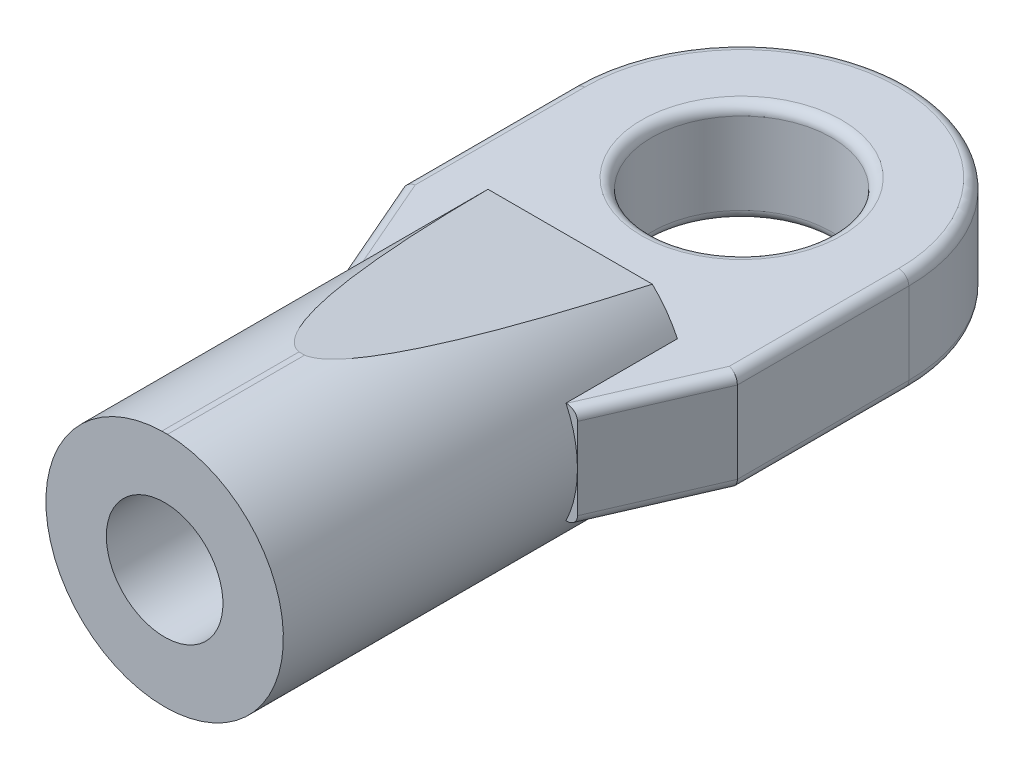
ISO-10303-21;
HEADER;
FILE_DESCRIPTION(('STEP AP214'),'2;1');
FILE_NAME('part.step','',(''),(''),'','','');
FILE_SCHEMA(('AUTOMOTIVE_DESIGN { 1 0 10303 214 1 1 1 1 }'));
ENDSEC;
DATA;
#1=APPLICATION_CONTEXT('core data for automotive mechanical design processes');
#2=APPLICATION_PROTOCOL_DEFINITION('international standard','automotive_design',2000,#1);
#3=PRODUCT_CONTEXT('',#1,'mechanical');
#4=PRODUCT('Part','Part','',(#3));
#5=PRODUCT_RELATED_PRODUCT_CATEGORY('part','',(#4));
#6=PRODUCT_DEFINITION_FORMATION('','',#4);
#7=PRODUCT_DEFINITION_CONTEXT('part definition',#1,'design');
#8=PRODUCT_DEFINITION('design','',#6,#7);
#9=PRODUCT_DEFINITION_SHAPE('','',#8);
#10=(LENGTH_UNIT() NAMED_UNIT(*) SI_UNIT(.MILLI.,.METRE.));
#11=(NAMED_UNIT(*) PLANE_ANGLE_UNIT() SI_UNIT($,.RADIAN.));
#12=(NAMED_UNIT(*) SI_UNIT($,.STERADIAN.) SOLID_ANGLE_UNIT());
#13=UNCERTAINTY_MEASURE_WITH_UNIT(LENGTH_MEASURE(1.E-05),#10,'distance_accuracy_value','');
#14=(GEOMETRIC_REPRESENTATION_CONTEXT(3) GLOBAL_UNCERTAINTY_ASSIGNED_CONTEXT((#13)) GLOBAL_UNIT_ASSIGNED_CONTEXT((#10,
#11,#12)) REPRESENTATION_CONTEXT('',''));
#15=CARTESIAN_POINT('',(0.,0.,0.));
#16=DIRECTION('',(0.,0.,1.));
#17=DIRECTION('',(1.,0.,0.));
#18=AXIS2_PLACEMENT_3D('',#15,#16,#17);
#19=CARTESIAN_POINT('',(0.,-1.21,0.));
#20=DIRECTION('',(0.,1.,0.));
#21=DIRECTION('',(0.,0.,1.));
#22=AXIS2_PLACEMENT_3D('',#19,#20,#21);
#23=TOROIDAL_SURFACE('',#22,2.967,0.3);
#24=CARTESIAN_POINT('',(0.,-1.51,0.));
#25=DIRECTION('',(0.,1.,0.));
#26=DIRECTION('',(0.,0.,1.));
#27=AXIS2_PLACEMENT_3D('',#24,#25,#26);
#28=CIRCLE('',#27,2.967);
#29=CARTESIAN_POINT('',(0.,-1.51,2.967));
#30=VERTEX_POINT('',#29);
#31=EDGE_CURVE('E43',#30,#30,#28,.T.);
#32=ORIENTED_EDGE('',*,*,#31,.F.);
#33=EDGE_LOOP('',(#32));
#34=FACE_BOUND('',#33,.T.);
#35=CARTESIAN_POINT('',(0.,-1.21,0.));
#36=DIRECTION('',(0.,1.,0.));
#37=DIRECTION('',(0.,0.,1.));
#38=AXIS2_PLACEMENT_3D('',#35,#36,#37);
#39=CIRCLE('',#38,2.667);
#40=CARTESIAN_POINT('',(0.,-1.21,-2.667));
#41=VERTEX_POINT('',#40);
#42=EDGE_CURVE('E11',#41,#41,#39,.F.);
#43=ORIENTED_EDGE('',*,*,#42,.F.);
#44=EDGE_LOOP('',(#43));
#45=FACE_BOUND('',#44,.T.);
#46=ADVANCED_FACE('F36',(#34,#45),#23,.T.);
#47=CARTESIAN_POINT('',(0.,1.21,0.));
#48=DIRECTION('',(0.,1.,0.));
#49=DIRECTION('',(0.,0.,1.));
#50=AXIS2_PLACEMENT_3D('',#47,#48,#49);
#51=TOROIDAL_SURFACE('',#50,2.967,0.3);
#52=CARTESIAN_POINT('',(0.,1.51,0.));
#53=DIRECTION('',(0.,1.,0.));
#54=DIRECTION('',(0.,0.,1.));
#55=AXIS2_PLACEMENT_3D('',#52,#53,#54);
#56=CIRCLE('',#55,2.967);
#57=CARTESIAN_POINT('',(0.,1.51,2.967));
#58=VERTEX_POINT('',#57);
#59=EDGE_CURVE('E390',#58,#58,#56,.F.);
#60=ORIENTED_EDGE('',*,*,#59,.F.);
#61=EDGE_LOOP('',(#60));
#62=FACE_BOUND('',#61,.T.);
#63=CARTESIAN_POINT('',(0.,1.21,0.));
#64=DIRECTION('',(0.,1.,0.));
#65=DIRECTION('',(0.,0.,1.));
#66=AXIS2_PLACEMENT_3D('',#63,#64,#65);
#67=CIRCLE('',#66,2.667);
#68=CARTESIAN_POINT('',(0.,1.21,-2.667));
#69=VERTEX_POINT('',#68);
#70=EDGE_CURVE('E393',#69,#69,#67,.T.);
#71=ORIENTED_EDGE('',*,*,#70,.F.);
#72=EDGE_LOOP('',(#71));
#73=FACE_BOUND('',#72,.T.);
#74=ADVANCED_FACE('F403',(#62,#73),#51,.T.);
#75=CARTESIAN_POINT('',(-4.65299999999999,1.21,0.));
#76=DIRECTION('',(0.,0.,-1.));
#77=DIRECTION('',(-1.,0.,0.));
#78=AXIS2_PLACEMENT_3D('',#75,#76,#77);
#79=CYLINDRICAL_SURFACE('',#78,0.3);
#80=CARTESIAN_POINT('',(-4.65299999999999,1.21,5.01762583711596));
#81=DIRECTION('',(-0.203560645995248,0.,-0.979062338874291));
#82=DIRECTION('',(-0.979062338874291,0.,0.203560645995247));
#83=AXIS2_PLACEMENT_3D('',#80,#81,#82);
#84=ELLIPSE('',#83,0.306415626552375,0.3);
#85=CARTESIAN_POINT('',(-4.65299999999999,1.51,5.01762583711596));
#86=VERTEX_POINT('',#85);
#87=CARTESIAN_POINT('',(-4.95299999999999,1.21,5.08));
#88=VERTEX_POINT('',#87);
#89=EDGE_CURVE('E57',#86,#88,#84,.F.);
#90=ORIENTED_EDGE('',*,*,#89,.F.);
#91=DIRECTION('',(0.,0.,1.));
#92=VECTOR('',#91,1.);
#93=CARTESIAN_POINT('',(-4.65299999999999,1.51,0.));
#94=LINE('',#93,#92);
#95=CARTESIAN_POINT('',(-4.65299999999999,1.51,0.));
#96=VERTEX_POINT('',#95);
#97=EDGE_CURVE('E354',#96,#86,#94,.T.);
#98=ORIENTED_EDGE('',*,*,#97,.F.);
#99=CARTESIAN_POINT('',(-4.65299999999999,1.21,0.));
#100=DIRECTION('',(0.,0.,1.));
#101=DIRECTION('',(1.,0.,0.));
#102=AXIS2_PLACEMENT_3D('',#99,#100,#101);
#103=CIRCLE('',#102,0.3);
#104=CARTESIAN_POINT('',(-4.95299999999999,1.21,0.));
#105=VERTEX_POINT('',#104);
#106=EDGE_CURVE('E387',#96,#105,#103,.T.);
#107=ORIENTED_EDGE('',*,*,#106,.T.);
#108=DIRECTION('',(0.,0.,1.));
#109=VECTOR('',#108,1.);
#110=CARTESIAN_POINT('',(-4.95299999999999,1.21,0.));
#111=LINE('',#110,#109);
#112=EDGE_CURVE('E377',#88,#105,#111,.F.);
#113=ORIENTED_EDGE('',*,*,#112,.F.);
#114=EDGE_LOOP('',(#90,#98,#107,#113));
#115=FACE_BOUND('',#114,.T.);
#116=ADVANCED_FACE('F414',(#115),#79,.T.);
#117=CARTESIAN_POINT('',(0.,1.21,0.));
#118=DIRECTION('',(0.,1.,0.));
#119=DIRECTION('',(0.,0.,1.));
#120=AXIS2_PLACEMENT_3D('',#117,#118,#119);
#121=TOROIDAL_SURFACE('',#120,4.65299999999998,0.3);
#122=ORIENTED_EDGE('',*,*,#106,.F.);
#123=CARTESIAN_POINT('',(0.,1.51,0.));
#124=DIRECTION('',(0.,1.,0.));
#125=DIRECTION('',(0.,0.,1.));
#126=AXIS2_PLACEMENT_3D('',#123,#124,#125);
#127=CIRCLE('',#126,4.65299999999998);
#128=CARTESIAN_POINT('',(4.65299999999997,1.51,0.));
#129=VERTEX_POINT('',#128);
#130=EDGE_CURVE('E357',#129,#96,#127,.T.);
#131=ORIENTED_EDGE('',*,*,#130,.F.);
#132=CARTESIAN_POINT('',(4.65299999999997,1.21,0.));
#133=DIRECTION('',(0.,0.,-1.));
#134=DIRECTION('',(-1.,0.,0.));
#135=AXIS2_PLACEMENT_3D('',#132,#133,#134);
#136=CIRCLE('',#135,0.3);
#137=CARTESIAN_POINT('',(4.95299999999997,1.21,0.));
#138=VERTEX_POINT('',#137);
#139=EDGE_CURVE('E385',#129,#138,#136,.T.);
#140=ORIENTED_EDGE('',*,*,#139,.T.);
#141=CARTESIAN_POINT('',(0.,1.21,0.));
#142=DIRECTION('',(0.,1.,0.));
#143=DIRECTION('',(0.,0.,1.));
#144=AXIS2_PLACEMENT_3D('',#141,#142,#143);
#145=CIRCLE('',#144,4.95299999999998);
#146=EDGE_CURVE('E374',#105,#138,#145,.F.);
#147=ORIENTED_EDGE('',*,*,#146,.F.);
#148=EDGE_LOOP('',(#122,#131,#140,#147));
#149=FACE_BOUND('',#148,.T.);
#150=ADVANCED_FACE('F419',(#149),#121,.T.);
#151=CARTESIAN_POINT('',(4.65299999999997,1.21,0.));
#152=DIRECTION('',(0.,0.,1.));
#153=DIRECTION('',(1.,0.,0.));
#154=AXIS2_PLACEMENT_3D('',#151,#152,#153);
#155=CYLINDRICAL_SURFACE('',#154,0.3);
#156=ORIENTED_EDGE('',*,*,#139,.F.);
#157=DIRECTION('',(0.,0.,-1.));
#158=VECTOR('',#157,1.);
#159=CARTESIAN_POINT('',(4.65299999999997,1.51,0.));
#160=LINE('',#159,#158);
#161=CARTESIAN_POINT('',(4.653,1.51,5.01762583711596));
#162=VERTEX_POINT('',#161);
#163=EDGE_CURVE('E360',#162,#129,#160,.T.);
#164=ORIENTED_EDGE('',*,*,#163,.F.);
#165=CARTESIAN_POINT('',(4.653,1.21,5.01762583711596));
#166=DIRECTION('',(-0.203560645995244,0.,0.979062338874292));
#167=DIRECTION('',(0.979062338874292,0.,0.203560645995244));
#168=AXIS2_PLACEMENT_3D('',#165,#166,#167);
#169=ELLIPSE('',#168,0.306415626552375,0.3);
#170=CARTESIAN_POINT('',(4.953,1.21,5.08));
#171=VERTEX_POINT('',#170);
#172=EDGE_CURVE('E383',#162,#171,#169,.F.);
#173=ORIENTED_EDGE('',*,*,#172,.T.);
#174=DIRECTION('',(0.,0.,-1.));
#175=VECTOR('',#174,1.);
#176=CARTESIAN_POINT('',(4.95299999999997,1.21,0.));
#177=LINE('',#176,#175);
#178=EDGE_CURVE('E371',#138,#171,#177,.F.);
#179=ORIENTED_EDGE('',*,*,#178,.F.);
#180=EDGE_LOOP('',(#156,#164,#173,#179));
#181=FACE_BOUND('',#180,.T.);
#182=ADVANCED_FACE('F431',(#181),#155,.T.);
#183=CARTESIAN_POINT('',(5.74799545962332,1.21,2.49816725745166));
#184=DIRECTION('',(-0.398597124341735,0.,0.917126126803996));
#185=DIRECTION('',(0.917126126803996,0.,0.398597124341735));
#186=AXIS2_PLACEMENT_3D('',#183,#184,#185);
#187=CYLINDRICAL_SURFACE('',#186,0.3);
#188=ORIENTED_EDGE('',*,*,#172,.F.);
#189=DIRECTION('',(0.398597124341735,0.,-0.917126126803996));
#190=VECTOR('',#189,1.);
#191=CARTESIAN_POINT('',(5.74799545962332,1.51,2.49816725745166));
#192=LINE('',#191,#190);
#193=CARTESIAN_POINT('',(3.19079122920809,1.51,8.382));
#194=VERTEX_POINT('',#193);
#195=EDGE_CURVE('E363',#194,#162,#192,.T.);
#196=ORIENTED_EDGE('',*,*,#195,.F.);
#197=CARTESIAN_POINT('',(3.19079122920809,1.21,8.382));
#198=DIRECTION('',(0.,0.,-1.));
#199=DIRECTION('',(-1.,0.,0.));
#200=AXIS2_PLACEMENT_3D('',#197,#198,#199);
#201=ELLIPSE('',#200,0.327108770791909,0.3);
#202=CARTESIAN_POINT('',(3.5179,1.21,8.382));
#203=VERTEX_POINT('',#202);
#204=EDGE_CURVE('E369',#203,#194,#201,.F.);
#205=ORIENTED_EDGE('',*,*,#204,.F.);
#206=DIRECTION('',(0.398597124341735,0.,-0.917126126803996));
#207=VECTOR('',#206,1.);
#208=CARTESIAN_POINT('',(6.02313329766452,1.21,2.61774639475419));
#209=LINE('',#208,#207);
#210=EDGE_CURVE('E366',#171,#203,#209,.F.);
#211=ORIENTED_EDGE('',*,*,#210,.F.);
#212=EDGE_LOOP('',(#188,#196,#205,#211));
#213=FACE_BOUND('',#212,.T.);
#214=ADVANCED_FACE('F427',(#213),#187,.T.);
#215=CARTESIAN_POINT('',(-5.74799545962332,1.21,2.49816725745168));
#216=DIRECTION('',(-0.398597124341737,0.,-0.917126126803995));
#217=DIRECTION('',(-0.917126126803995,0.,0.398597124341737));
#218=AXIS2_PLACEMENT_3D('',#215,#216,#217);
#219=CYLINDRICAL_SURFACE('',#218,0.3);
#220=DIRECTION('',(0.398597124341737,0.,0.917126126803995));
#221=VECTOR('',#220,1.);
#222=CARTESIAN_POINT('',(-5.74799545962332,1.51,2.49816725745168));
#223=LINE('',#222,#221);
#224=CARTESIAN_POINT('',(-3.19079122920808,1.51,8.382));
#225=VERTEX_POINT('',#224);
#226=EDGE_CURVE('E351',#86,#225,#223,.T.);
#227=ORIENTED_EDGE('',*,*,#226,.F.);
#228=ORIENTED_EDGE('',*,*,#89,.T.);
#229=DIRECTION('',(0.398597124341737,0.,0.917126126803995));
#230=VECTOR('',#229,1.);
#231=CARTESIAN_POINT('',(-6.02313329766452,1.21,2.6177463947542));
#232=LINE('',#231,#230);
#233=CARTESIAN_POINT('',(-3.51789999999999,1.21,8.382));
#234=VERTEX_POINT('',#233);
#235=EDGE_CURVE('E380',#234,#88,#232,.F.);
#236=ORIENTED_EDGE('',*,*,#235,.F.);
#237=CARTESIAN_POINT('',(-3.19079122920808,1.21,8.382));
#238=DIRECTION('',(0.,0.,-1.));
#239=DIRECTION('',(-1.,0.,0.));
#240=AXIS2_PLACEMENT_3D('',#237,#238,#239);
#241=ELLIPSE('',#240,0.32710877079191,0.3);
#242=EDGE_CURVE('E50',#225,#234,#241,.F.);
#243=ORIENTED_EDGE('',*,*,#242,.F.);
#244=EDGE_LOOP('',(#227,#228,#236,#243));
#245=FACE_BOUND('',#244,.T.);
#246=ADVANCED_FACE('F424',(#245),#219,.T.);
#247=CARTESIAN_POINT('',(4.65299999999997,-1.21,0.));
#248=DIRECTION('',(0.,0.,1.));
#249=DIRECTION('',(1.,0.,0.));
#250=AXIS2_PLACEMENT_3D('',#247,#248,#249);
#251=CYLINDRICAL_SURFACE('',#250,0.3);
#252=CARTESIAN_POINT('',(4.653,-1.21,5.01762583711596));
#253=DIRECTION('',(-0.203560645995244,0.,0.979062338874292));
#254=DIRECTION('',(-0.979062338874292,0.,-0.203560645995244));
#255=AXIS2_PLACEMENT_3D('',#252,#253,#254);
#256=ELLIPSE('',#255,0.306415626552375,0.3);
#257=CARTESIAN_POINT('',(4.653,-1.51,5.01762583711596));
#258=VERTEX_POINT('',#257);
#259=CARTESIAN_POINT('',(4.953,-1.21,5.08));
#260=VERTEX_POINT('',#259);
#261=EDGE_CURVE('E348',#258,#260,#256,.T.);
#262=ORIENTED_EDGE('',*,*,#261,.F.);
#263=DIRECTION('',(0.,0.,1.));
#264=VECTOR('',#263,1.);
#265=CARTESIAN_POINT('',(4.65299999999997,-1.51,0.));
#266=LINE('',#265,#264);
#267=CARTESIAN_POINT('',(4.65299999999997,-1.51,0.));
#268=VERTEX_POINT('',#267);
#269=EDGE_CURVE('E308',#268,#258,#266,.T.);
#270=ORIENTED_EDGE('',*,*,#269,.F.);
#271=CARTESIAN_POINT('',(4.65299999999997,-1.21,0.));
#272=DIRECTION('',(0.,0.,1.));
#273=DIRECTION('',(1.,0.,0.));
#274=AXIS2_PLACEMENT_3D('',#271,#272,#273);
#275=CIRCLE('',#274,0.3);
#276=CARTESIAN_POINT('',(4.95299999999997,-1.21,0.));
#277=VERTEX_POINT('',#276);
#278=EDGE_CURVE('E345',#268,#277,#275,.T.);
#279=ORIENTED_EDGE('',*,*,#278,.T.);
#280=DIRECTION('',(0.,0.,1.));
#281=VECTOR('',#280,1.);
#282=CARTESIAN_POINT('',(4.95299999999997,-1.21,0.));
#283=LINE('',#282,#281);
#284=EDGE_CURVE('E331',#260,#277,#283,.F.);
#285=ORIENTED_EDGE('',*,*,#284,.F.);
#286=EDGE_LOOP('',(#262,#270,#279,#285));
#287=FACE_BOUND('',#286,.T.);
#288=ADVANCED_FACE('F426',(#287),#251,.T.);
#289=CARTESIAN_POINT('',(0.,-1.21,0.));
#290=DIRECTION('',(0.,1.,0.));
#291=DIRECTION('',(0.,0.,1.));
#292=AXIS2_PLACEMENT_3D('',#289,#290,#291);
#293=TOROIDAL_SURFACE('',#292,4.65299999999998,0.3);
#294=ORIENTED_EDGE('',*,*,#278,.F.);
#295=CARTESIAN_POINT('',(0.,-1.51,0.));
#296=DIRECTION('',(0.,1.,0.));
#297=DIRECTION('',(0.,0.,1.));
#298=AXIS2_PLACEMENT_3D('',#295,#296,#297);
#299=CIRCLE('',#298,4.65299999999998);
#300=CARTESIAN_POINT('',(-4.65299999999999,-1.51,0.));
#301=VERTEX_POINT('',#300);
#302=EDGE_CURVE('E311',#301,#268,#299,.F.);
#303=ORIENTED_EDGE('',*,*,#302,.F.);
#304=CARTESIAN_POINT('',(-4.65299999999999,-1.21,0.));
#305=DIRECTION('',(0.,0.,-1.));
#306=DIRECTION('',(-1.,0.,0.));
#307=AXIS2_PLACEMENT_3D('',#304,#305,#306);
#308=CIRCLE('',#307,0.3);
#309=CARTESIAN_POINT('',(-4.95299999999999,-1.21,0.));
#310=VERTEX_POINT('',#309);
#311=EDGE_CURVE('E342',#301,#310,#308,.T.);
#312=ORIENTED_EDGE('',*,*,#311,.T.);
#313=CARTESIAN_POINT('',(0.,-1.21,0.));
#314=DIRECTION('',(0.,1.,0.));
#315=DIRECTION('',(0.,0.,1.));
#316=AXIS2_PLACEMENT_3D('',#313,#314,#315);
#317=CIRCLE('',#316,4.95299999999998);
#318=EDGE_CURVE('E328',#277,#310,#317,.T.);
#319=ORIENTED_EDGE('',*,*,#318,.F.);
#320=EDGE_LOOP('',(#294,#303,#312,#319));
#321=FACE_BOUND('',#320,.T.);
#322=ADVANCED_FACE('F447',(#321),#293,.T.);
#323=CARTESIAN_POINT('',(-4.65299999999999,-1.21,0.));
#324=DIRECTION('',(0.,0.,-1.));
#325=DIRECTION('',(-1.,0.,0.));
#326=AXIS2_PLACEMENT_3D('',#323,#324,#325);
#327=CYLINDRICAL_SURFACE('',#326,0.3);
#328=ORIENTED_EDGE('',*,*,#311,.F.);
#329=DIRECTION('',(0.,0.,-1.));
#330=VECTOR('',#329,1.);
#331=CARTESIAN_POINT('',(-4.65299999999999,-1.51,0.));
#332=LINE('',#331,#330);
#333=CARTESIAN_POINT('',(-4.65299999999999,-1.51,5.01762583711596));
#334=VERTEX_POINT('',#333);
#335=EDGE_CURVE('E314',#334,#301,#332,.T.);
#336=ORIENTED_EDGE('',*,*,#335,.F.);
#337=CARTESIAN_POINT('',(-4.65299999999999,-1.21,5.01762583711596));
#338=DIRECTION('',(-0.203560645995248,0.,-0.979062338874291));
#339=DIRECTION('',(0.979062338874291,0.,-0.203560645995247));
#340=AXIS2_PLACEMENT_3D('',#337,#338,#339);
#341=ELLIPSE('',#340,0.306415626552375,0.3);
#342=CARTESIAN_POINT('',(-4.95299999999999,-1.21,5.08));
#343=VERTEX_POINT('',#342);
#344=EDGE_CURVE('E339',#334,#343,#341,.T.);
#345=ORIENTED_EDGE('',*,*,#344,.T.);
#346=DIRECTION('',(0.,0.,-1.));
#347=VECTOR('',#346,1.);
#348=CARTESIAN_POINT('',(-4.95299999999999,-1.21,0.));
#349=LINE('',#348,#347);
#350=EDGE_CURVE('E325',#310,#343,#349,.F.);
#351=ORIENTED_EDGE('',*,*,#350,.F.);
#352=EDGE_LOOP('',(#328,#336,#345,#351));
#353=FACE_BOUND('',#352,.T.);
#354=ADVANCED_FACE('F451',(#353),#327,.T.);
#355=CARTESIAN_POINT('',(-5.74799545962332,-1.21,2.49816725745168));
#356=DIRECTION('',(-0.398597124341737,0.,-0.917126126803995));
#357=DIRECTION('',(-0.917126126803995,0.,0.398597124341737));
#358=AXIS2_PLACEMENT_3D('',#355,#356,#357);
#359=CYLINDRICAL_SURFACE('',#358,0.3);
#360=ORIENTED_EDGE('',*,*,#344,.F.);
#361=DIRECTION('',(-0.398597124341737,0.,-0.917126126803995));
#362=VECTOR('',#361,1.);
#363=CARTESIAN_POINT('',(-5.74799545962332,-1.51,2.49816725745168));
#364=LINE('',#363,#362);
#365=CARTESIAN_POINT('',(-3.19079122920808,-1.51,8.382));
#366=VERTEX_POINT('',#365);
#367=EDGE_CURVE('E317',#366,#334,#364,.T.);
#368=ORIENTED_EDGE('',*,*,#367,.F.);
#369=CARTESIAN_POINT('',(-3.19079122920808,-1.21,8.382));
#370=DIRECTION('',(0.,0.,-1.));
#371=DIRECTION('',(-1.,0.,0.));
#372=AXIS2_PLACEMENT_3D('',#369,#370,#371);
#373=ELLIPSE('',#372,0.32710877079191,0.3);
#374=CARTESIAN_POINT('',(-3.51789999999999,-1.21,8.382));
#375=VERTEX_POINT('',#374);
#376=EDGE_CURVE('E323',#375,#366,#373,.F.);
#377=ORIENTED_EDGE('',*,*,#376,.F.);
#378=DIRECTION('',(-0.398597124341737,0.,-0.917126126803995));
#379=VECTOR('',#378,1.);
#380=CARTESIAN_POINT('',(-3.51789999999999,-1.21,8.382));
#381=LINE('',#380,#379);
#382=EDGE_CURVE('E320',#343,#375,#381,.F.);
#383=ORIENTED_EDGE('',*,*,#382,.F.);
#384=EDGE_LOOP('',(#360,#368,#377,#383));
#385=FACE_BOUND('',#384,.T.);
#386=ADVANCED_FACE('F443',(#385),#359,.T.);
#387=CARTESIAN_POINT('',(5.74799545962332,-1.21,2.49816725745166));
#388=DIRECTION('',(-0.398597124341735,0.,0.917126126803996));
#389=DIRECTION('',(0.917126126803996,0.,0.398597124341735));
#390=AXIS2_PLACEMENT_3D('',#387,#388,#389);
#391=CYLINDRICAL_SURFACE('',#390,0.3);
#392=DIRECTION('',(-0.398597124341735,0.,0.917126126803996));
#393=VECTOR('',#392,1.);
#394=CARTESIAN_POINT('',(5.74799545962332,-1.51,2.49816725745166));
#395=LINE('',#394,#393);
#396=CARTESIAN_POINT('',(3.19079122920809,-1.51,8.382));
#397=VERTEX_POINT('',#396);
#398=EDGE_CURVE('E305',#258,#397,#395,.T.);
#399=ORIENTED_EDGE('',*,*,#398,.F.);
#400=ORIENTED_EDGE('',*,*,#261,.T.);
#401=DIRECTION('',(-0.398597124341735,0.,0.917126126803996));
#402=VECTOR('',#401,1.);
#403=CARTESIAN_POINT('',(3.5179,-1.21,8.382));
#404=LINE('',#403,#402);
#405=CARTESIAN_POINT('',(3.5179,-1.21,8.382));
#406=VERTEX_POINT('',#405);
#407=EDGE_CURVE('E334',#406,#260,#404,.F.);
#408=ORIENTED_EDGE('',*,*,#407,.F.);
#409=CARTESIAN_POINT('',(3.19079122920809,-1.21,8.382));
#410=DIRECTION('',(0.,0.,-1.));
#411=DIRECTION('',(-1.,0.,0.));
#412=AXIS2_PLACEMENT_3D('',#409,#410,#411);
#413=ELLIPSE('',#412,0.327108770791909,0.3);
#414=EDGE_CURVE('E337',#397,#406,#413,.F.);
#415=ORIENTED_EDGE('',*,*,#414,.F.);
#416=EDGE_LOOP('',(#399,#400,#408,#415));
#417=FACE_BOUND('',#416,.T.);
#418=ADVANCED_FACE('F439',(#417),#391,.T.);
#419=CARTESIAN_POINT('',(0.,0.,5.08));
#420=DIRECTION('',(0.,0.,1.));
#421=DIRECTION('',(1.,0.,0.));
#422=AXIS2_PLACEMENT_3D('',#419,#420,#421);
#423=PLANE('',#422);
#424=DIRECTION('',(-1.,0.,0.));
#425=VECTOR('',#424,1.);
#426=CARTESIAN_POINT('',(0.,-1.51,5.08));
#427=LINE('',#426,#425);
#428=CARTESIAN_POINT('',(3.17734486796759,-1.51,5.08));
#429=VERTEX_POINT('',#428);
#430=CARTESIAN_POINT('',(-3.17734486796759,-1.51,5.08));
#431=VERTEX_POINT('',#430);
#432=EDGE_CURVE('E241',#429,#431,#427,.T.);
#433=ORIENTED_EDGE('',*,*,#432,.F.);
#434=CARTESIAN_POINT('',(0.,0.,5.08));
#435=DIRECTION('',(0.,0.,-1.));
#436=DIRECTION('',(-1.,0.,0.));
#437=AXIS2_PLACEMENT_3D('',#434,#435,#436);
#438=CIRCLE('',#437,3.5179);
#439=CARTESIAN_POINT('',(2.43290068253873,-2.54098694977022,5.08));
#440=VERTEX_POINT('',#439);
#441=EDGE_CURVE('E298',#429,#440,#438,.T.);
#442=ORIENTED_EDGE('',*,*,#441,.T.);
#443=DIRECTION('',(1.,0.,0.));
#444=VECTOR('',#443,1.);
#445=CARTESIAN_POINT('',(-6.17972211068289,-2.54098694977022,5.07999999999999));
#446=LINE('',#445,#444);
#447=CARTESIAN_POINT('',(-2.43290068253874,-2.54098694977022,5.07999999999999));
#448=VERTEX_POINT('',#447);
#449=EDGE_CURVE('E268',#448,#440,#446,.T.);
#450=ORIENTED_EDGE('',*,*,#449,.F.);
#451=EDGE_CURVE('E295',#448,#431,#438,.T.);
#452=ORIENTED_EDGE('',*,*,#451,.T.);
#453=EDGE_LOOP('',(#433,#442,#450,#452));
#454=FACE_BOUND('',#453,.T.);
#455=ADVANCED_FACE('F442',(#454),#423,.F.);
#456=CARTESIAN_POINT('',(0.,0.,5.6642));
#457=DIRECTION('',(0.,0.,1.));
#458=DIRECTION('',(1.,0.,0.));
#459=AXIS2_PLACEMENT_3D('',#456,#457,#458);
#460=PLANE('',#459);
#461=CARTESIAN_POINT('',(0.,0.,5.6642));
#462=DIRECTION('',(0.,0.,-1.));
#463=DIRECTION('',(-1.,0.,0.));
#464=AXIS2_PLACEMENT_3D('',#461,#462,#463);
#465=CIRCLE('',#464,1.7272);
#466=CARTESIAN_POINT('',(0.83852241472724,-1.51,5.6642));
#467=VERTEX_POINT('',#466);
#468=CARTESIAN_POINT('',(-0.83852241472724,-1.51,5.6642));
#469=VERTEX_POINT('',#468);
#470=EDGE_CURVE('E230',#467,#469,#465,.T.);
#471=ORIENTED_EDGE('',*,*,#470,.F.);
#472=DIRECTION('',(-1.,0.,0.));
#473=VECTOR('',#472,1.);
#474=CARTESIAN_POINT('',(0.,-1.51,5.6642));
#475=LINE('',#474,#473);
#476=EDGE_CURVE('E302',#467,#469,#475,.T.);
#477=ORIENTED_EDGE('',*,*,#476,.T.);
#478=EDGE_LOOP('',(#471,#477));
#479=FACE_BOUND('',#478,.T.);
#480=ADVANCED_FACE('F463',(#479),#460,.T.);
#481=CARTESIAN_POINT('',(2.43496060353404,2.53901305022979,5.08));
#482=VERTEX_POINT('',#481);
#483=CARTESIAN_POINT('',(3.17734486796759,1.51,5.08));
#484=VERTEX_POINT('',#483);
#485=EDGE_CURVE('E299',#482,#484,#438,.T.);
#486=ORIENTED_EDGE('',*,*,#485,.T.);
#487=DIRECTION('',(-1.,0.,0.));
#488=VECTOR('',#487,1.);
#489=CARTESIAN_POINT('',(0.,1.51,5.08));
#490=LINE('',#489,#488);
#491=CARTESIAN_POINT('',(-3.17734486796759,1.51,5.08));
#492=VERTEX_POINT('',#491);
#493=EDGE_CURVE('E254',#484,#492,#490,.T.);
#494=ORIENTED_EDGE('',*,*,#493,.T.);
#495=CARTESIAN_POINT('',(-2.43496060353404,2.53901305022979,5.08));
#496=VERTEX_POINT('',#495);
#497=EDGE_CURVE('E294',#492,#496,#438,.T.);
#498=ORIENTED_EDGE('',*,*,#497,.T.);
#499=DIRECTION('',(1.,0.,0.));
#500=VECTOR('',#499,1.);
#501=CARTESIAN_POINT('',(-6.17972211068289,2.53901305022978,5.07999999999999));
#502=LINE('',#501,#500);
#503=EDGE_CURVE('E273',#496,#482,#502,.T.);
#504=ORIENTED_EDGE('',*,*,#503,.T.);
#505=EDGE_LOOP('',(#486,#494,#498,#504));
#506=FACE_BOUND('',#505,.T.);
#507=ADVANCED_FACE('F459',(#506),#423,.F.);
#508=CARTESIAN_POINT('',(0.,0.,0.));
#509=DIRECTION('',(0.,0.,-1.));
#510=DIRECTION('',(-1.,0.,0.));
#511=AXIS2_PLACEMENT_3D('',#508,#509,#510);
#512=CYLINDRICAL_SURFACE('',#511,3.5179);
#513=CARTESIAN_POINT('',(0.,0.,8.382));
#514=DIRECTION('',(0.,0.,-1.));
#515=DIRECTION('',(-1.,0.,0.));
#516=AXIS2_PLACEMENT_3D('',#513,#514,#515);
#517=CIRCLE('',#516,3.5179);
#518=CARTESIAN_POINT('',(3.17734486796759,1.51,8.382));
#519=VERTEX_POINT('',#518);
#520=CARTESIAN_POINT('',(3.5179,0.,8.38200000000001));
#521=VERTEX_POINT('',#520);
#522=EDGE_CURVE('E262',#519,#521,#517,.T.);
#523=ORIENTED_EDGE('',*,*,#522,.F.);
#524=DIRECTION('',(0.,0.,-1.));
#525=VECTOR('',#524,1.);
#526=CARTESIAN_POINT('',(3.17734486796759,1.51,0.));
#527=LINE('',#526,#525);
#528=EDGE_CURVE('E256',#519,#484,#527,.T.);
#529=ORIENTED_EDGE('',*,*,#528,.T.);
#530=ORIENTED_EDGE('',*,*,#485,.F.);
#531=CARTESIAN_POINT('',(0.,0.,-15.5618463564135));
#532=DIRECTION('',(0.,0.992519880266169,-0.122083116262772));
#533=DIRECTION('',(0.,-0.122083116262772,-0.992519880266169));
#534=AXIS2_PLACEMENT_3D('',#531,#532,#533);
#535=ELLIPSE('',#534,28.8156143756034,3.5179);
#536=CARTESIAN_POINT('',(0.0833247089606279,3.51691305022979,13.0302));
#537=VERTEX_POINT('',#536);
#538=EDGE_CURVE('E263',#482,#537,#535,.F.);
#539=ORIENTED_EDGE('',*,*,#538,.T.);
#540=DIRECTION('',(0.,0.,-1.));
#541=VECTOR('',#540,1.);
#542=CARTESIAN_POINT('',(0.0833247089606286,3.51691305022979,0.));
#543=LINE('',#542,#541);
#544=CARTESIAN_POINT('',(0.0833247089606833,3.51691305022979,17.0942));
#545=VERTEX_POINT('',#544);
#546=EDGE_CURVE('E265',#537,#545,#543,.F.);
#547=ORIENTED_EDGE('',*,*,#546,.T.);
#548=CARTESIAN_POINT('',(0.,0.,17.0942));
#549=DIRECTION('',(0.,0.,-1.));
#550=DIRECTION('',(-1.,0.,0.));
#551=AXIS2_PLACEMENT_3D('',#548,#549,#550);
#552=CIRCLE('',#551,3.5179);
#553=CARTESIAN_POINT('',(-0.0833247089606852,3.51691305022979,17.0942));
#554=VERTEX_POINT('',#553);
#555=EDGE_CURVE('E291',#545,#554,#552,.T.);
#556=ORIENTED_EDGE('',*,*,#555,.T.);
#557=DIRECTION('',(0.,0.,-1.));
#558=VECTOR('',#557,1.);
#559=CARTESIAN_POINT('',(-0.0833247089606286,3.51691305022979,0.));
#560=LINE('',#559,#558);
#561=CARTESIAN_POINT('',(-0.0833247089606292,3.51691305022979,13.0302));
#562=VERTEX_POINT('',#561);
#563=EDGE_CURVE('E276',#562,#554,#560,.F.);
#564=ORIENTED_EDGE('',*,*,#563,.F.);
#565=CARTESIAN_POINT('',(0.,0.,-15.5618463564135));
#566=DIRECTION('',(0.,-0.992519880266169,0.122083116262772));
#567=DIRECTION('',(0.,-0.122083116262772,-0.992519880266169));
#568=AXIS2_PLACEMENT_3D('',#565,#566,#567);
#569=ELLIPSE('',#568,28.8156143756034,3.5179);
#570=EDGE_CURVE('E269',#496,#562,#569,.F.);
#571=ORIENTED_EDGE('',*,*,#570,.F.);
#572=ORIENTED_EDGE('',*,*,#497,.F.);
#573=DIRECTION('',(0.,0.,-1.));
#574=VECTOR('',#573,1.);
#575=CARTESIAN_POINT('',(-3.17734486796759,1.51,0.));
#576=LINE('',#575,#574);
#577=CARTESIAN_POINT('',(-3.17734486796759,1.51,8.382));
#578=VERTEX_POINT('',#577);
#579=EDGE_CURVE('E251',#492,#578,#576,.F.);
#580=ORIENTED_EDGE('',*,*,#579,.T.);
#581=CARTESIAN_POINT('',(-3.51789999999999,0.,8.382));
#582=VERTEX_POINT('',#581);
#583=EDGE_CURVE('E261',#582,#578,#517,.T.);
#584=ORIENTED_EDGE('',*,*,#583,.F.);
#585=CARTESIAN_POINT('',(-3.17734486796759,-1.51,8.382));
#586=VERTEX_POINT('',#585);
#587=EDGE_CURVE('E258',#586,#582,#517,.T.);
#588=ORIENTED_EDGE('',*,*,#587,.F.);
#589=DIRECTION('',(0.,0.,-1.));
#590=VECTOR('',#589,1.);
#591=CARTESIAN_POINT('',(-3.17734486796759,-1.51,0.));
#592=LINE('',#591,#590);
#593=EDGE_CURVE('E233',#431,#586,#592,.F.);
#594=ORIENTED_EDGE('',*,*,#593,.F.);
#595=ORIENTED_EDGE('',*,*,#451,.F.);
#596=CARTESIAN_POINT('',(0.,0.,-15.577893903327));
#597=DIRECTION('',(0.,0.992519880266169,0.12208311626277));
#598=DIRECTION('',(0.,0.12208311626277,-0.992519880266169));
#599=AXIS2_PLACEMENT_3D('',#596,#597,#598);
#600=ELLIPSE('',#599,28.8156143756039,3.5179);
#601=EDGE_CURVE('E266',#440,#448,#600,.F.);
#602=ORIENTED_EDGE('',*,*,#601,.F.);
#603=ORIENTED_EDGE('',*,*,#441,.F.);
#604=DIRECTION('',(0.,0.,-1.));
#605=VECTOR('',#604,1.);
#606=CARTESIAN_POINT('',(3.17734486796759,-1.51,0.));
#607=LINE('',#606,#605);
#608=CARTESIAN_POINT('',(3.17734486796759,-1.51,8.382));
#609=VERTEX_POINT('',#608);
#610=EDGE_CURVE('E244',#609,#429,#607,.T.);
#611=ORIENTED_EDGE('',*,*,#610,.F.);
#612=EDGE_CURVE('E568',#521,#609,#517,.T.);
#613=ORIENTED_EDGE('',*,*,#612,.F.);
#614=EDGE_LOOP('',(#523,#529,#530,#539,#547,#556,#564,#571,#572,#580,#584,#588,#594,#595,#602,
#603,#611,#613));
#615=FACE_BOUND('',#614,.T.);
#616=ADVANCED_FACE('F462',(#615),#512,.T.);
#617=CARTESIAN_POINT('',(0.,0.,17.0942));
#618=DIRECTION('',(0.,0.,1.));
#619=DIRECTION('',(1.,0.,0.));
#620=AXIS2_PLACEMENT_3D('',#617,#618,#619);
#621=PLANE('',#620);
#622=CARTESIAN_POINT('',(0.,0.,17.0942));
#623=DIRECTION('',(0.,0.,-1.));
#624=DIRECTION('',(-1.,0.,0.));
#625=AXIS2_PLACEMENT_3D('',#622,#623,#624);
#626=CIRCLE('',#625,1.7272);
#627=CARTESIAN_POINT('',(-1.7272,0.,17.0942));
#628=VERTEX_POINT('',#627);
#629=EDGE_CURVE('E288',#628,#628,#626,.T.);
#630=ORIENTED_EDGE('',*,*,#629,.T.);
#631=EDGE_LOOP('',(#630));
#632=FACE_BOUND('',#631,.T.);
#633=DIRECTION('',(1.,0.,0.));
#634=VECTOR('',#633,1.);
#635=CARTESIAN_POINT('',(-6.17972211068289,3.51691305022979,17.0942));
#636=LINE('',#635,#634);
#637=EDGE_CURVE('E282',#554,#545,#636,.T.);
#638=ORIENTED_EDGE('',*,*,#637,.F.);
#639=ORIENTED_EDGE('',*,*,#555,.F.);
#640=EDGE_LOOP('',(#638,#639));
#641=FACE_BOUND('',#640,.T.);
#642=ADVANCED_FACE('F467',(#632,#641),#621,.T.);
#643=CARTESIAN_POINT('',(0.,0.,0.));
#644=DIRECTION('',(0.,0.,-1.));
#645=DIRECTION('',(-1.,0.,0.));
#646=AXIS2_PLACEMENT_3D('',#643,#644,#645);
#647=CYLINDRICAL_SURFACE('',#646,1.7272);
#648=DIRECTION('',(0.,0.,-1.));
#649=VECTOR('',#648,1.);
#650=CARTESIAN_POINT('',(0.838522414727239,1.51,0.));
#651=LINE('',#650,#649);
#652=CARTESIAN_POINT('',(0.838522414727239,1.51,8.382));
#653=VERTEX_POINT('',#652);
#654=CARTESIAN_POINT('',(0.83852241472724,1.51,5.6642));
#655=VERTEX_POINT('',#654);
#656=EDGE_CURVE('E249',#653,#655,#651,.T.);
#657=ORIENTED_EDGE('',*,*,#656,.F.);
#658=CARTESIAN_POINT('',(0.,0.,8.382));
#659=DIRECTION('',(0.,0.,-1.));
#660=DIRECTION('',(-1.,0.,0.));
#661=AXIS2_PLACEMENT_3D('',#658,#659,#660);
#662=CIRCLE('',#661,1.7272);
#663=CARTESIAN_POINT('',(0.838522414727239,-1.51,8.382));
#664=VERTEX_POINT('',#663);
#665=EDGE_CURVE('E213',#653,#664,#662,.T.);
#666=ORIENTED_EDGE('',*,*,#665,.T.);
#667=DIRECTION('',(0.,0.,-1.));
#668=VECTOR('',#667,1.);
#669=CARTESIAN_POINT('',(0.838522414727239,-1.51,0.));
#670=LINE('',#669,#668);
#671=EDGE_CURVE('E221',#664,#467,#670,.T.);
#672=ORIENTED_EDGE('',*,*,#671,.T.);
#673=ORIENTED_EDGE('',*,*,#470,.T.);
#674=DIRECTION('',(0.,0.,-1.));
#675=VECTOR('',#674,1.);
#676=CARTESIAN_POINT('',(-0.838522414727239,-1.51,0.));
#677=LINE('',#676,#675);
#678=CARTESIAN_POINT('',(-0.83852241472724,-1.51,8.382));
#679=VERTEX_POINT('',#678);
#680=EDGE_CURVE('E218',#469,#679,#677,.F.);
#681=ORIENTED_EDGE('',*,*,#680,.T.);
#682=CARTESIAN_POINT('',(-0.83852241472724,1.51,8.382));
#683=VERTEX_POINT('',#682);
#684=EDGE_CURVE('E203',#679,#683,#662,.T.);
#685=ORIENTED_EDGE('',*,*,#684,.T.);
#686=DIRECTION('',(0.,0.,-1.));
#687=VECTOR('',#686,1.);
#688=CARTESIAN_POINT('',(-0.838522414727239,1.51,0.));
#689=LINE('',#688,#687);
#690=CARTESIAN_POINT('',(-0.83852241472724,1.51,5.6642));
#691=VERTEX_POINT('',#690);
#692=EDGE_CURVE('E247',#691,#683,#689,.F.);
#693=ORIENTED_EDGE('',*,*,#692,.F.);
#694=EDGE_CURVE('E285',#691,#655,#465,.T.);
#695=ORIENTED_EDGE('',*,*,#694,.T.);
#696=EDGE_LOOP('',(#657,#666,#672,#673,#681,#685,#693,#695));
#697=FACE_BOUND('',#696,.T.);
#698=ORIENTED_EDGE('',*,*,#629,.F.);
#699=EDGE_LOOP('',(#698));
#700=FACE_BOUND('',#699,.T.);
#701=ADVANCED_FACE('F227',(#697,#700),#647,.F.);
#702=DIRECTION('',(-1.,0.,0.));
#703=VECTOR('',#702,1.);
#704=CARTESIAN_POINT('',(0.,1.51,5.6642));
#705=LINE('',#704,#703);
#706=EDGE_CURVE('E214',#655,#691,#705,.T.);
#707=ORIENTED_EDGE('',*,*,#706,.F.);
#708=ORIENTED_EDGE('',*,*,#694,.F.);
#709=EDGE_LOOP('',(#707,#708));
#710=FACE_BOUND('',#709,.T.);
#711=ADVANCED_FACE('F474',(#710),#460,.T.);
#712=CARTESIAN_POINT('',(-6.17972211068289,3.51691305022979,17.0942));
#713=DIRECTION('',(0.,-1.,0.));
#714=DIRECTION('',(0.,0.,-1.));
#715=AXIS2_PLACEMENT_3D('',#712,#713,#714);
#716=PLANE('',#715);
#717=DIRECTION('',(1.,0.,0.));
#718=VECTOR('',#717,1.);
#719=CARTESIAN_POINT('',(-6.17972211068289,3.51691305022979,13.0302));
#720=LINE('',#719,#718);
#721=EDGE_CURVE('E272',#562,#537,#720,.T.);
#722=ORIENTED_EDGE('',*,*,#721,.F.);
#723=ORIENTED_EDGE('',*,*,#563,.T.);
#724=ORIENTED_EDGE('',*,*,#637,.T.);
#725=ORIENTED_EDGE('',*,*,#546,.F.);
#726=EDGE_LOOP('',(#722,#723,#724,#725));
#727=FACE_BOUND('',#726,.T.);
#728=ADVANCED_FACE('F477',(#727),#716,.F.);
#729=CARTESIAN_POINT('',(-6.17972211068289,3.51691305022979,13.0302));
#730=DIRECTION('',(0.,-0.992519880266169,0.122083116262772));
#731=DIRECTION('',(0.,-0.122083116262772,-0.992519880266169));
#732=AXIS2_PLACEMENT_3D('',#729,#730,#731);
#733=PLANE('',#732);
#734=ORIENTED_EDGE('',*,*,#503,.F.);
#735=ORIENTED_EDGE('',*,*,#570,.T.);
#736=ORIENTED_EDGE('',*,*,#721,.T.);
#737=ORIENTED_EDGE('',*,*,#538,.F.);
#738=EDGE_LOOP('',(#734,#735,#736,#737));
#739=FACE_BOUND('',#738,.T.);
#740=ADVANCED_FACE('F482',(#739),#733,.F.);
#741=CARTESIAN_POINT('',(-6.17972211068289,-2.54098694977022,5.07999999999999));
#742=DIRECTION('',(0.,0.992519880266169,0.12208311626277));
#743=DIRECTION('',(0.,-0.12208311626277,0.992519880266169));
#744=AXIS2_PLACEMENT_3D('',#741,#742,#743);
#745=PLANE('',#744);
#746=ORIENTED_EDGE('',*,*,#449,.T.);
#747=ORIENTED_EDGE('',*,*,#601,.T.);
#748=EDGE_LOOP('',(#746,#747));
#749=FACE_BOUND('',#748,.T.);
#750=ADVANCED_FACE('F479',(#749),#745,.F.);
#751=CARTESIAN_POINT('',(0.,-1.51,0.));
#752=DIRECTION('',(0.,1.,0.));
#753=DIRECTION('',(0.,0.,1.));
#754=AXIS2_PLACEMENT_3D('',#751,#752,#753);
#755=PLANE('',#754);
#756=ORIENTED_EDGE('',*,*,#671,.F.);
#757=DIRECTION('',(1.,0.,0.));
#758=VECTOR('',#757,1.);
#759=CARTESIAN_POINT('',(-3.51789999999999,-1.51,8.382));
#760=LINE('',#759,#758);
#761=EDGE_CURVE('E206',#679,#664,#760,.T.);
#762=ORIENTED_EDGE('',*,*,#761,.F.);
#763=ORIENTED_EDGE('',*,*,#680,.F.);
#764=ORIENTED_EDGE('',*,*,#476,.F.);
#765=EDGE_LOOP('',(#756,#762,#763,#764));
#766=FACE_BOUND('',#765,.T.);
#767=ADVANCED_FACE('F217',(#766),#755,.F.);
#768=CARTESIAN_POINT('',(0.,1.51,0.));
#769=DIRECTION('',(0.,1.,0.));
#770=DIRECTION('',(0.,0.,1.));
#771=AXIS2_PLACEMENT_3D('',#768,#769,#770);
#772=PLANE('',#771);
#773=DIRECTION('',(1.,0.,0.));
#774=VECTOR('',#773,1.);
#775=CARTESIAN_POINT('',(-3.51789999999999,1.51,8.382));
#776=LINE('',#775,#774);
#777=EDGE_CURVE('E209',#683,#653,#776,.T.);
#778=ORIENTED_EDGE('',*,*,#777,.T.);
#779=ORIENTED_EDGE('',*,*,#656,.T.);
#780=ORIENTED_EDGE('',*,*,#706,.T.);
#781=ORIENTED_EDGE('',*,*,#692,.T.);
#782=EDGE_LOOP('',(#778,#779,#780,#781));
#783=FACE_BOUND('',#782,.T.);
#784=ADVANCED_FACE('F506',(#783),#772,.T.);
#785=CARTESIAN_POINT('',(-3.51789999999999,1.51,8.382));
#786=DIRECTION('',(0.,0.,-1.));
#787=DIRECTION('',(-1.,0.,0.));
#788=AXIS2_PLACEMENT_3D('',#785,#786,#787);
#789=PLANE('',#788);
#790=ORIENTED_EDGE('',*,*,#665,.F.);
#791=ORIENTED_EDGE('',*,*,#777,.F.);
#792=ORIENTED_EDGE('',*,*,#684,.F.);
#793=ORIENTED_EDGE('',*,*,#761,.T.);
#794=EDGE_LOOP('',(#790,#791,#792,#793));
#795=FACE_BOUND('',#794,.T.);
#796=ADVANCED_FACE('F205',(#795),#789,.F.);
#797=DIRECTION('',(0.,-1.,0.));
#798=VECTOR('',#797,1.);
#799=CARTESIAN_POINT('',(3.5179,1.51,8.382));
#800=LINE('',#799,#798);
#801=EDGE_CURVE('E549',#203,#521,#800,.T.);
#802=ORIENTED_EDGE('',*,*,#801,.F.);
#803=ORIENTED_EDGE('',*,*,#204,.T.);
#804=EDGE_CURVE('E533',#519,#194,#776,.T.);
#805=ORIENTED_EDGE('',*,*,#804,.F.);
#806=ORIENTED_EDGE('',*,*,#522,.T.);
#807=EDGE_LOOP('',(#802,#803,#805,#806));
#808=FACE_BOUND('',#807,.T.);
#809=ADVANCED_FACE('F505',(#808),#789,.F.);
#810=EDGE_CURVE('E223',#609,#397,#760,.T.);
#811=ORIENTED_EDGE('',*,*,#810,.T.);
#812=ORIENTED_EDGE('',*,*,#414,.T.);
#813=EDGE_CURVE('E546',#521,#406,#800,.T.);
#814=ORIENTED_EDGE('',*,*,#813,.F.);
#815=ORIENTED_EDGE('',*,*,#612,.T.);
#816=EDGE_LOOP('',(#811,#812,#814,#815));
#817=FACE_BOUND('',#816,.T.);
#818=ADVANCED_FACE('F577',(#817),#789,.F.);
#819=EDGE_CURVE('E540',#225,#578,#776,.T.);
#820=ORIENTED_EDGE('',*,*,#819,.F.);
#821=ORIENTED_EDGE('',*,*,#242,.T.);
#822=DIRECTION('',(0.,-1.,0.));
#823=VECTOR('',#822,1.);
#824=CARTESIAN_POINT('',(-3.51789999999999,1.51,8.382));
#825=LINE('',#824,#823);
#826=EDGE_CURVE('E552',#234,#582,#825,.T.);
#827=ORIENTED_EDGE('',*,*,#826,.T.);
#828=ORIENTED_EDGE('',*,*,#583,.T.);
#829=EDGE_LOOP('',(#820,#821,#827,#828));
#830=FACE_BOUND('',#829,.T.);
#831=ADVANCED_FACE('F527',(#830),#789,.F.);
#832=EDGE_CURVE('E551',#582,#375,#825,.T.);
#833=ORIENTED_EDGE('',*,*,#832,.T.);
#834=ORIENTED_EDGE('',*,*,#376,.T.);
#835=EDGE_CURVE('E222',#366,#586,#760,.T.);
#836=ORIENTED_EDGE('',*,*,#835,.T.);
#837=ORIENTED_EDGE('',*,*,#587,.T.);
#838=EDGE_LOOP('',(#833,#834,#836,#837));
#839=FACE_BOUND('',#838,.T.);
#840=ADVANCED_FACE('F507',(#839),#789,.F.);
#841=ORIENTED_EDGE('',*,*,#59,.T.);
#842=EDGE_LOOP('',(#841));
#843=FACE_BOUND('',#842,.T.);
#844=ORIENTED_EDGE('',*,*,#804,.T.);
#845=ORIENTED_EDGE('',*,*,#195,.T.);
#846=ORIENTED_EDGE('',*,*,#163,.T.);
#847=ORIENTED_EDGE('',*,*,#130,.T.);
#848=ORIENTED_EDGE('',*,*,#97,.T.);
#849=ORIENTED_EDGE('',*,*,#226,.T.);
#850=ORIENTED_EDGE('',*,*,#819,.T.);
#851=ORIENTED_EDGE('',*,*,#579,.F.);
#852=ORIENTED_EDGE('',*,*,#493,.F.);
#853=ORIENTED_EDGE('',*,*,#528,.F.);
#854=EDGE_LOOP('',(#844,#845,#846,#847,#848,#849,#850,#851,#852,#853));
#855=FACE_BOUND('',#854,.T.);
#856=ADVANCED_FACE('F518',(#843,#855),#772,.T.);
#857=ORIENTED_EDGE('',*,*,#31,.T.);
#858=EDGE_LOOP('',(#857));
#859=FACE_BOUND('',#858,.T.);
#860=ORIENTED_EDGE('',*,*,#835,.F.);
#861=ORIENTED_EDGE('',*,*,#367,.T.);
#862=ORIENTED_EDGE('',*,*,#335,.T.);
#863=ORIENTED_EDGE('',*,*,#302,.T.);
#864=ORIENTED_EDGE('',*,*,#269,.T.);
#865=ORIENTED_EDGE('',*,*,#398,.T.);
#866=ORIENTED_EDGE('',*,*,#810,.F.);
#867=ORIENTED_EDGE('',*,*,#610,.T.);
#868=ORIENTED_EDGE('',*,*,#432,.T.);
#869=ORIENTED_EDGE('',*,*,#593,.T.);
#870=EDGE_LOOP('',(#860,#861,#862,#863,#864,#865,#866,#867,#868,#869));
#871=FACE_BOUND('',#870,.T.);
#872=ADVANCED_FACE('F398',(#859,#871),#755,.F.);
#873=CARTESIAN_POINT('',(0.,1.51,0.));
#874=DIRECTION('',(0.,-1.,0.));
#875=DIRECTION('',(0.,0.,-1.));
#876=AXIS2_PLACEMENT_3D('',#873,#874,#875);
#877=CYLINDRICAL_SURFACE('',#876,4.95299999999998);
#878=DIRECTION('',(0.,-1.,0.));
#879=VECTOR('',#878,1.);
#880=CARTESIAN_POINT('',(-4.95299999999999,1.51,0.));
#881=LINE('',#880,#879);
#882=EDGE_CURVE('E231',#105,#310,#881,.T.);
#883=ORIENTED_EDGE('',*,*,#882,.F.);
#884=ORIENTED_EDGE('',*,*,#146,.T.);
#885=DIRECTION('',(0.,-1.,0.));
#886=VECTOR('',#885,1.);
#887=CARTESIAN_POINT('',(4.95299999999997,1.51,0.));
#888=LINE('',#887,#886);
#889=EDGE_CURVE('E541',#138,#277,#888,.T.);
#890=ORIENTED_EDGE('',*,*,#889,.T.);
#891=ORIENTED_EDGE('',*,*,#318,.T.);
#892=EDGE_LOOP('',(#883,#884,#890,#891));
#893=FACE_BOUND('',#892,.T.);
#894=ADVANCED_FACE('F490',(#893),#877,.T.);
#895=CARTESIAN_POINT('',(-4.95299999999999,1.51,0.));
#896=DIRECTION('',(1.,0.,0.));
#897=DIRECTION('',(0.,0.,-1.));
#898=AXIS2_PLACEMENT_3D('',#895,#896,#897);
#899=PLANE('',#898);
#900=DIRECTION('',(0.,-1.,0.));
#901=VECTOR('',#900,1.);
#902=CARTESIAN_POINT('',(-4.95299999999999,1.51,5.08));
#903=LINE('',#902,#901);
#904=EDGE_CURVE('E235',#88,#343,#903,.T.);
#905=ORIENTED_EDGE('',*,*,#904,.F.);
#906=ORIENTED_EDGE('',*,*,#112,.T.);
#907=ORIENTED_EDGE('',*,*,#882,.T.);
#908=ORIENTED_EDGE('',*,*,#350,.T.);
#909=EDGE_LOOP('',(#905,#906,#907,#908));
#910=FACE_BOUND('',#909,.T.);
#911=ADVANCED_FACE('F493',(#910),#899,.F.);
#912=CARTESIAN_POINT('',(-3.51789999999999,1.51,8.382));
#913=DIRECTION('',(0.917126126803995,0.,-0.398597124341737));
#914=DIRECTION('',(-0.398597124341737,0.,-0.917126126803995));
#915=AXIS2_PLACEMENT_3D('',#912,#913,#914);
#916=PLANE('',#915);
#917=ORIENTED_EDGE('',*,*,#826,.F.);
#918=ORIENTED_EDGE('',*,*,#235,.T.);
#919=ORIENTED_EDGE('',*,*,#904,.T.);
#920=ORIENTED_EDGE('',*,*,#382,.T.);
#921=ORIENTED_EDGE('',*,*,#832,.F.);
#922=EDGE_LOOP('',(#917,#918,#919,#920,#921));
#923=FACE_BOUND('',#922,.T.);
#924=ADVANCED_FACE('F497',(#923),#916,.F.);
#925=CARTESIAN_POINT('',(3.5179,1.51,8.382));
#926=DIRECTION('',(-0.917126126803996,0.,-0.398597124341735));
#927=DIRECTION('',(-0.398597124341735,0.,0.917126126803996));
#928=AXIS2_PLACEMENT_3D('',#925,#926,#927);
#929=PLANE('',#928);
#930=DIRECTION('',(0.,-1.,0.));
#931=VECTOR('',#930,1.);
#932=CARTESIAN_POINT('',(4.953,1.51,5.08));
#933=LINE('',#932,#931);
#934=EDGE_CURVE('E543',#171,#260,#933,.T.);
#935=ORIENTED_EDGE('',*,*,#934,.F.);
#936=ORIENTED_EDGE('',*,*,#210,.T.);
#937=ORIENTED_EDGE('',*,*,#801,.T.);
#938=ORIENTED_EDGE('',*,*,#813,.T.);
#939=ORIENTED_EDGE('',*,*,#407,.T.);
#940=EDGE_LOOP('',(#935,#936,#937,#938,#939));
#941=FACE_BOUND('',#940,.T.);
#942=ADVANCED_FACE('F501',(#941),#929,.F.);
#943=CARTESIAN_POINT('',(4.95299999999997,1.51,0.));
#944=DIRECTION('',(-1.,0.,0.));
#945=DIRECTION('',(0.,0.,1.));
#946=AXIS2_PLACEMENT_3D('',#943,#944,#945);
#947=PLANE('',#946);
#948=ORIENTED_EDGE('',*,*,#889,.F.);
#949=ORIENTED_EDGE('',*,*,#178,.T.);
#950=ORIENTED_EDGE('',*,*,#934,.T.);
#951=ORIENTED_EDGE('',*,*,#284,.T.);
#952=EDGE_LOOP('',(#948,#949,#950,#951));
#953=FACE_BOUND('',#952,.T.);
#954=ADVANCED_FACE('F409',(#953),#947,.F.);
#955=CARTESIAN_POINT('',(0.,1.51,0.));
#956=DIRECTION('',(0.,-1.,0.));
#957=DIRECTION('',(0.,0.,-1.));
#958=AXIS2_PLACEMENT_3D('',#955,#956,#957);
#959=CYLINDRICAL_SURFACE('',#958,2.667);
#960=CARTESIAN_POINT('',(0.,-1.21,-2.667));
#961=CARTESIAN_POINT('',(0.,-1.18479166666667,-2.667));
#962=CARTESIAN_POINT('',(0.,-1.15958333333333,-2.667));
#963=CARTESIAN_POINT('',(0.,-1.10916666666667,-2.667));
#964=CARTESIAN_POINT('',(0.,-1.08395833333333,-2.667));
#965=CARTESIAN_POINT('',(0.,-1.03354166666667,-2.667));
#966=CARTESIAN_POINT('',(0.,-1.00833333333333,-2.667));
#967=CARTESIAN_POINT('',(0.,-0.957916666666667,-2.667));
#968=CARTESIAN_POINT('',(0.,-0.932708333333334,-2.667));
#969=CARTESIAN_POINT('',(0.,-0.882291666666667,-2.667));
#970=CARTESIAN_POINT('',(0.,-0.857083333333334,-2.667));
#971=CARTESIAN_POINT('',(0.,-0.806666666666667,-2.667));
#972=CARTESIAN_POINT('',(0.,-0.781458333333334,-2.667));
#973=CARTESIAN_POINT('',(0.,-0.731041666666667,-2.667));
#974=CARTESIAN_POINT('',(0.,-0.705833333333334,-2.667));
#975=CARTESIAN_POINT('',(0.,-0.655416666666667,-2.667));
#976=CARTESIAN_POINT('',(0.,-0.630208333333333,-2.667));
#977=CARTESIAN_POINT('',(0.,-0.579791666666667,-2.667));
#978=CARTESIAN_POINT('',(0.,-0.554583333333334,-2.667));
#979=CARTESIAN_POINT('',(0.,-0.504166666666667,-2.667));
#980=CARTESIAN_POINT('',(0.,-0.478958333333334,-2.667));
#981=CARTESIAN_POINT('',(0.,-0.428541666666667,-2.667));
#982=CARTESIAN_POINT('',(0.,-0.403333333333334,-2.667));
#983=CARTESIAN_POINT('',(0.,-0.352916666666667,-2.667));
#984=CARTESIAN_POINT('',(0.,-0.327708333333334,-2.667));
#985=CARTESIAN_POINT('',(0.,-0.277291666666667,-2.667));
#986=CARTESIAN_POINT('',(0.,-0.252083333333334,-2.667));
#987=CARTESIAN_POINT('',(0.,-0.201666666666667,-2.667));
#988=CARTESIAN_POINT('',(0.,-0.176458333333334,-2.667));
#989=CARTESIAN_POINT('',(0.,-0.126041666666667,-2.667));
#990=CARTESIAN_POINT('',(0.,-0.100833333333334,-2.667));
#991=CARTESIAN_POINT('',(0.,-0.0504166666666669,-2.667));
#992=CARTESIAN_POINT('',(0.,-0.0252083333333335,-2.667));
#993=CARTESIAN_POINT('',(0.,0.0252083333333331,-2.667));
#994=CARTESIAN_POINT('',(0.,0.0504166666666664,-2.667));
#995=CARTESIAN_POINT('',(0.,0.100833333333333,-2.667));
#996=CARTESIAN_POINT('',(0.,0.126041666666667,-2.667));
#997=CARTESIAN_POINT('',(0.,0.176458333333333,-2.667));
#998=CARTESIAN_POINT('',(0.,0.201666666666667,-2.667));
#999=CARTESIAN_POINT('',(0.,0.252083333333333,-2.667));
#1000=CARTESIAN_POINT('',(0.,0.277291666666667,-2.667));
#1001=CARTESIAN_POINT('',(0.,0.327708333333333,-2.667));
#1002=CARTESIAN_POINT('',(0.,0.352916666666667,-2.667));
#1003=CARTESIAN_POINT('',(0.,0.403333333333333,-2.667));
#1004=CARTESIAN_POINT('',(0.,0.428541666666667,-2.667));
#1005=CARTESIAN_POINT('',(0.,0.478958333333333,-2.667));
#1006=CARTESIAN_POINT('',(0.,0.504166666666667,-2.667));
#1007=CARTESIAN_POINT('',(0.,0.554583333333333,-2.667));
#1008=CARTESIAN_POINT('',(0.,0.579791666666667,-2.667));
#1009=CARTESIAN_POINT('',(0.,0.630208333333333,-2.667));
#1010=CARTESIAN_POINT('',(0.,0.655416666666667,-2.667));
#1011=CARTESIAN_POINT('',(0.,0.705833333333333,-2.667));
#1012=CARTESIAN_POINT('',(0.,0.731041666666667,-2.667));
#1013=CARTESIAN_POINT('',(0.,0.781458333333333,-2.667));
#1014=CARTESIAN_POINT('',(0.,0.806666666666667,-2.667));
#1015=CARTESIAN_POINT('',(0.,0.857083333333334,-2.667));
#1016=CARTESIAN_POINT('',(0.,0.882291666666667,-2.667));
#1017=CARTESIAN_POINT('',(0.,0.932708333333333,-2.667));
#1018=CARTESIAN_POINT('',(0.,0.957916666666667,-2.667));
#1019=CARTESIAN_POINT('',(0.,1.00833333333333,-2.667));
#1020=CARTESIAN_POINT('',(0.,1.03354166666667,-2.667));
#1021=CARTESIAN_POINT('',(0.,1.08395833333333,-2.667));
#1022=CARTESIAN_POINT('',(0.,1.10916666666667,-2.667));
#1023=CARTESIAN_POINT('',(0.,1.15958333333333,-2.667));
#1024=CARTESIAN_POINT('',(0.,1.18479166666667,-2.667));
#1025=CARTESIAN_POINT('',(0.,1.21,-2.667));
#1026=B_SPLINE_CURVE_WITH_KNOTS('',3,(#960,#961,#962,#963,#964,#965,#966,#967,#968,#969,#970,
#971,#972,#973,#974,#975,#976,#977,#978,#979,#980,#981,#982,#983,#984,#985,#986,#987,#988,#989,
#990,#991,#992,#993,#994,#995,#996,#997,#998,#999,#1000,#1001,#1002,#1003,#1004,#1005,#1006,
#1007,#1008,#1009,#1010,#1011,#1012,#1013,#1014,#1015,#1016,#1017,#1018,#1019,#1020,#1021,#1022,
#1023,#1024,#1025),.UNSPECIFIED.,.F.,.F.,(4,2,2,2,2,2,2,2,2,2,2,2,2,2,2,2,2,2,2,2,2,2,2,2,2,2,2,
2,2,2,2,2,4),(0.,0.0756250000000002,0.15125,0.226875,0.3025,0.378125,0.45375,0.529375,
0.605000000000001,0.680625,0.75625,0.831875,0.9075,0.983125,1.05875,1.134375,1.21,1.285625,
1.36125,1.436875,1.5125,1.588125,1.66375,1.739375,1.815,1.890625,1.96625,2.041875,2.1175,
2.193125,2.26875,2.344375,2.42),.UNSPECIFIED.);
#1027=EDGE_CURVE('BSEAM406',#41,#69,#1026,.T.);
#1028=ORIENTED_EDGE('',*,*,#42,.T.);
#1029=ORIENTED_EDGE('',*,*,#70,.T.);
#1030=ORIENTED_EDGE('',*,*,#1027,.T.);
#1031=ORIENTED_EDGE('',*,*,#1027,.F.);
#1032=EDGE_LOOP('',(#1028,#1030,#1029,#1031));
#1033=FACE_BOUND('',#1032,.T.);
#1034=ADVANCED_FACE('F406',(#1033),#959,.F.);
#1035=CLOSED_SHELL('',(#46,#74,#116,#150,#182,#214,#246,#288,#322,#354,#386,#418,#455,#480,#507,
#616,#642,#701,#711,#728,#740,#750,#767,#784,#796,#809,#818,#831,#840,#856,#872,#894,#911,#924,
#942,#954,#1034));
#1036=MANIFOLD_SOLID_BREP('B2',#1035);
#1037=ADVANCED_BREP_SHAPE_REPRESENTATION('',(#18,#1036),#14);
#1038=SHAPE_DEFINITION_REPRESENTATION(#9,#1037);
ENDSEC;
END-ISO-10303-21;
